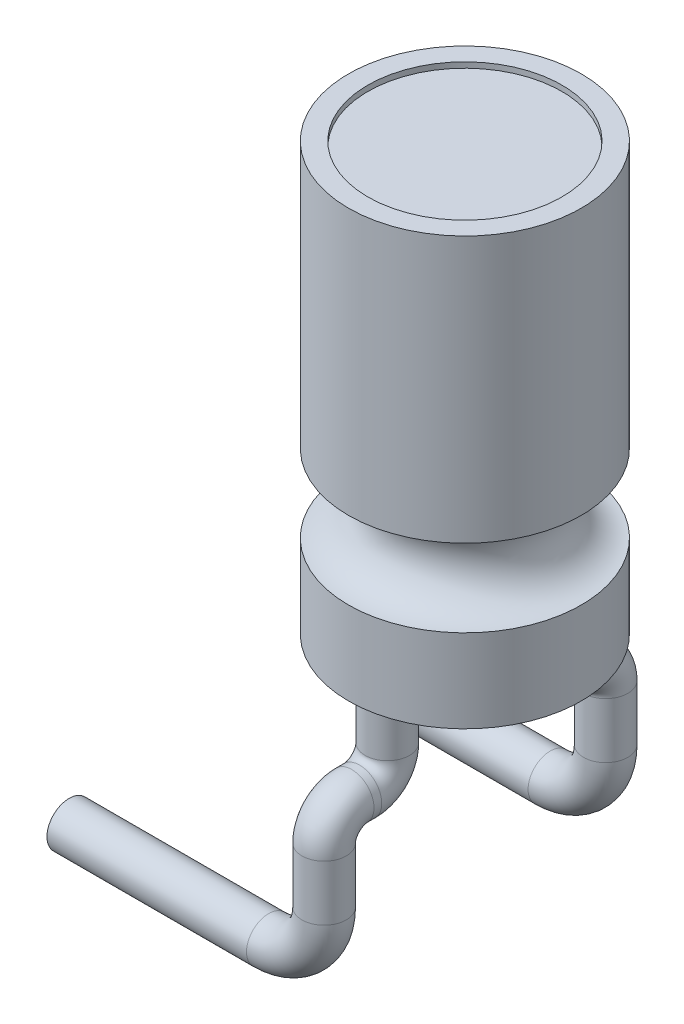
ISO-10303-21;
HEADER;
FILE_DESCRIPTION(('STEP AP214'),'2;1');
FILE_NAME('part.step','',(''),(''),'','','');
FILE_SCHEMA(('AUTOMOTIVE_DESIGN { 1 0 10303 214 1 1 1 1 }'));
ENDSEC;
DATA;
#1=APPLICATION_CONTEXT('core data for automotive mechanical design processes');
#2=APPLICATION_PROTOCOL_DEFINITION('international standard','automotive_design',2000,#1);
#3=PRODUCT_CONTEXT('',#1,'mechanical');
#4=PRODUCT('Part','Part','',(#3));
#5=PRODUCT_RELATED_PRODUCT_CATEGORY('part','',(#4));
#6=PRODUCT_DEFINITION_FORMATION('','',#4);
#7=PRODUCT_DEFINITION_CONTEXT('part definition',#1,'design');
#8=PRODUCT_DEFINITION('design','',#6,#7);
#9=PRODUCT_DEFINITION_SHAPE('','',#8);
#10=(LENGTH_UNIT() NAMED_UNIT(*) SI_UNIT(.MILLI.,.METRE.));
#11=(NAMED_UNIT(*) PLANE_ANGLE_UNIT() SI_UNIT($,.RADIAN.));
#12=(NAMED_UNIT(*) SI_UNIT($,.STERADIAN.) SOLID_ANGLE_UNIT());
#13=UNCERTAINTY_MEASURE_WITH_UNIT(LENGTH_MEASURE(1.E-05),#10,'distance_accuracy_value','');
#14=(GEOMETRIC_REPRESENTATION_CONTEXT(3) GLOBAL_UNCERTAINTY_ASSIGNED_CONTEXT((#13)) GLOBAL_UNIT_ASSIGNED_CONTEXT((#10,
#11,#12)) REPRESENTATION_CONTEXT('',''));
#15=CARTESIAN_POINT('',(0.,0.,0.));
#16=DIRECTION('',(0.,0.,1.));
#17=DIRECTION('',(1.,0.,0.));
#18=AXIS2_PLACEMENT_3D('',#15,#16,#17);
#19=CARTESIAN_POINT('',(2.1,27.5164236634825,0.));
#20=DIRECTION('',(0.,1.,0.));
#21=DIRECTION('',(0.,0.,1.));
#22=AXIS2_PLACEMENT_3D('',#19,#20,#21);
#23=PLANE('',#22);
#24=CARTESIAN_POINT('',(0.,27.5164236634825,-1.4));
#25=DIRECTION('',(0.,1.,0.));
#26=DIRECTION('',(0.,0.,1.));
#27=AXIS2_PLACEMENT_3D('',#24,#25,#26);
#28=CIRCLE('',#27,0.4);
#29=CARTESIAN_POINT('',(0.,27.5164236634825,-1.));
#30=VERTEX_POINT('',#29);
#31=EDGE_CURVE('E93',#30,#30,#28,.T.);
#32=ORIENTED_EDGE('',*,*,#31,.T.);
#33=EDGE_LOOP('',(#32));
#34=FACE_BOUND('',#33,.T.);
#35=CARTESIAN_POINT('',(0.,27.5164236634825,0.));
#36=DIRECTION('',(0.,1.,0.));
#37=DIRECTION('',(0.,0.,1.));
#38=AXIS2_PLACEMENT_3D('',#35,#36,#37);
#39=CIRCLE('',#38,2.1);
#40=CARTESIAN_POINT('',(0.,27.5164236634825,2.1));
#41=VERTEX_POINT('',#40);
#42=EDGE_CURVE('E41',#41,#41,#39,.T.);
#43=ORIENTED_EDGE('',*,*,#42,.F.);
#44=EDGE_LOOP('',(#43));
#45=FACE_BOUND('',#44,.T.);
#46=CARTESIAN_POINT('',(0.,27.5164236634825,1.4));
#47=DIRECTION('',(0.,1.,0.));
#48=DIRECTION('',(0.,0.,1.));
#49=AXIS2_PLACEMENT_3D('',#46,#47,#48);
#50=CIRCLE('',#49,0.4);
#51=CARTESIAN_POINT('',(0.,27.5164236634825,1.8));
#52=VERTEX_POINT('',#51);
#53=EDGE_CURVE('E10',#52,#52,#50,.F.);
#54=ORIENTED_EDGE('',*,*,#53,.F.);
#55=EDGE_LOOP('',(#54));
#56=FACE_BOUND('',#55,.T.);
#57=ADVANCED_FACE('F35',(#34,#45,#56),#23,.F.);
#58=CARTESIAN_POINT('',(0.,48.4017094017094,0.));
#59=DIRECTION('',(0.,1.,0.));
#60=DIRECTION('',(0.,0.,1.));
#61=AXIS2_PLACEMENT_3D('',#58,#59,#60);
#62=CYLINDRICAL_SURFACE('',#61,2.1);
#63=CARTESIAN_POINT('',(0.,29.0164236634825,0.));
#64=DIRECTION('',(0.,1.,0.));
#65=DIRECTION('',(0.,0.,1.));
#66=AXIS2_PLACEMENT_3D('',#63,#64,#65);
#67=CIRCLE('',#66,2.1);
#68=CARTESIAN_POINT('',(0.,29.0164236634825,2.1));
#69=VERTEX_POINT('',#68);
#70=EDGE_CURVE('E45',#69,#69,#67,.T.);
#71=ORIENTED_EDGE('',*,*,#70,.F.);
#72=EDGE_LOOP('',(#71));
#73=FACE_BOUND('',#72,.T.);
#74=ORIENTED_EDGE('',*,*,#42,.T.);
#75=EDGE_LOOP('',(#74));
#76=FACE_BOUND('',#75,.T.);
#77=ADVANCED_FACE('F127',(#73,#76),#62,.T.);
#78=CARTESIAN_POINT('',(0.,29.7164236634825,0.));
#79=DIRECTION('',(0.,1.,0.));
#80=DIRECTION('',(0.,0.,1.));
#81=AXIS2_PLACEMENT_3D('',#78,#79,#80);
#82=TOROIDAL_SURFACE('',#81,2.1,0.699999999999999);
#83=CARTESIAN_POINT('',(0.,30.4164236634825,0.));
#84=DIRECTION('',(0.,1.,0.));
#85=DIRECTION('',(0.,0.,1.));
#86=AXIS2_PLACEMENT_3D('',#83,#84,#85);
#87=CIRCLE('',#86,2.1);
#88=CARTESIAN_POINT('',(0.,30.4164236634825,2.1));
#89=VERTEX_POINT('',#88);
#90=EDGE_CURVE('E49',#89,#89,#87,.T.);
#91=ORIENTED_EDGE('',*,*,#90,.F.);
#92=EDGE_LOOP('',(#91));
#93=FACE_BOUND('',#92,.T.);
#94=ORIENTED_EDGE('',*,*,#70,.T.);
#95=EDGE_LOOP('',(#94));
#96=FACE_BOUND('',#95,.T.);
#97=ADVANCED_FACE('F132',(#93,#96),#82,.F.);
#98=CARTESIAN_POINT('',(0.,48.4017094017094,0.));
#99=DIRECTION('',(0.,1.,0.));
#100=DIRECTION('',(0.,0.,1.));
#101=AXIS2_PLACEMENT_3D('',#98,#99,#100);
#102=CYLINDRICAL_SURFACE('',#101,2.1);
#103=CARTESIAN_POINT('',(0.,35.2164236634825,0.));
#104=DIRECTION('',(0.,1.,0.));
#105=DIRECTION('',(0.,0.,1.));
#106=AXIS2_PLACEMENT_3D('',#103,#104,#105);
#107=CIRCLE('',#106,2.1);
#108=CARTESIAN_POINT('',(0.,35.2164236634825,2.1));
#109=VERTEX_POINT('',#108);
#110=EDGE_CURVE('E54',#109,#109,#107,.T.);
#111=ORIENTED_EDGE('',*,*,#110,.F.);
#112=EDGE_LOOP('',(#111));
#113=FACE_BOUND('',#112,.T.);
#114=ORIENTED_EDGE('',*,*,#90,.T.);
#115=EDGE_LOOP('',(#114));
#116=FACE_BOUND('',#115,.T.);
#117=ADVANCED_FACE('F202',(#113,#116),#102,.T.);
#118=CARTESIAN_POINT('',(0.,35.2164236634825,0.));
#119=DIRECTION('',(0.,-1.,0.));
#120=DIRECTION('',(0.,0.,-1.));
#121=AXIS2_PLACEMENT_3D('',#118,#119,#120);
#122=PLANE('',#121);
#123=CARTESIAN_POINT('',(0.,35.2164236634825,0.));
#124=DIRECTION('',(0.,1.,0.));
#125=DIRECTION('',(0.,0.,1.));
#126=AXIS2_PLACEMENT_3D('',#123,#124,#125);
#127=CIRCLE('',#126,1.75);
#128=CARTESIAN_POINT('',(0.,35.2164236634825,1.75));
#129=VERTEX_POINT('',#128);
#130=EDGE_CURVE('E60',#129,#129,#127,.T.);
#131=ORIENTED_EDGE('',*,*,#130,.F.);
#132=EDGE_LOOP('',(#131));
#133=FACE_BOUND('',#132,.T.);
#134=ORIENTED_EDGE('',*,*,#110,.T.);
#135=EDGE_LOOP('',(#134));
#136=FACE_BOUND('',#135,.T.);
#137=ADVANCED_FACE('F198',(#133,#136),#122,.F.);
#138=CARTESIAN_POINT('',(0.,35.1164236634825,0.));
#139=DIRECTION('',(0.,1.,0.));
#140=DIRECTION('',(0.,0.,1.));
#141=AXIS2_PLACEMENT_3D('',#138,#139,#140);
#142=CYLINDRICAL_SURFACE('',#141,1.75);
#143=CARTESIAN_POINT('',(0.,35.1164236634825,0.));
#144=DIRECTION('',(0.,1.,0.));
#145=DIRECTION('',(0.,0.,1.));
#146=AXIS2_PLACEMENT_3D('',#143,#144,#145);
#147=CIRCLE('',#146,1.75);
#148=CARTESIAN_POINT('',(0.,35.1164236634825,1.75));
#149=VERTEX_POINT('',#148);
#150=EDGE_CURVE('E57',#149,#149,#147,.T.);
#151=ORIENTED_EDGE('',*,*,#150,.F.);
#152=EDGE_LOOP('',(#151));
#153=FACE_BOUND('',#152,.T.);
#154=ORIENTED_EDGE('',*,*,#130,.T.);
#155=EDGE_LOOP('',(#154));
#156=FACE_BOUND('',#155,.T.);
#157=ADVANCED_FACE('F194',(#153,#156),#142,.F.);
#158=CARTESIAN_POINT('',(0.,35.1164236634825,0.));
#159=DIRECTION('',(0.,1.,0.));
#160=DIRECTION('',(0.,0.,1.));
#161=AXIS2_PLACEMENT_3D('',#158,#159,#160);
#162=PLANE('',#161);
#163=ORIENTED_EDGE('',*,*,#150,.T.);
#164=EDGE_LOOP('',(#163));
#165=FACE_BOUND('',#164,.T.);
#166=ADVANCED_FACE('F190',(#165),#162,.T.);
#167=CARTESIAN_POINT('',(0.,25.5164236634825,2.04));
#168=DIRECTION('',(1.,0.,0.));
#169=DIRECTION('',(0.,0.,-1.));
#170=AXIS2_PLACEMENT_3D('',#167,#168,#169);
#171=TOROIDAL_SURFACE('',#170,0.500000000000004,0.4);
#172=CARTESIAN_POINT('',(0.,26.0164236634825,2.04));
#173=DIRECTION('',(0.,0.,1.));
#174=DIRECTION('',(0.,-1.,0.));
#175=AXIS2_PLACEMENT_3D('',#172,#173,#174);
#176=CIRCLE('',#175,0.4);
#177=CARTESIAN_POINT('',(0.,26.4164236634825,2.03999999999999));
#178=VERTEX_POINT('',#177);
#179=EDGE_CURVE('E66',#178,#178,#176,.T.);
#180=CARTESIAN_POINT('',(0.,25.5164236634825,2.54));
#181=DIRECTION('',(0.,-1.,0.));
#182=DIRECTION('',(0.,0.,-1.));
#183=AXIS2_PLACEMENT_3D('',#180,#181,#182);
#184=CIRCLE('',#183,0.4);
#185=CARTESIAN_POINT('',(0.,25.5164236634825,2.94));
#186=VERTEX_POINT('',#185);
#187=EDGE_CURVE('E63',#186,#186,#184,.T.);
#188=CARTESIAN_POINT('',(0.,25.5164236634825,2.04));
#189=DIRECTION('',(1.,0.,0.));
#190=DIRECTION('',(0.,0.,-1.));
#191=AXIS2_PLACEMENT_3D('',#188,#189,#190);
#192=CIRCLE('',#191,0.900000000000004);
#193=EDGE_CURVE('',#178,#186,#192,.T.);
#194=ORIENTED_EDGE('',*,*,#179,.T.);
#195=ORIENTED_EDGE('',*,*,#187,.F.);
#196=ORIENTED_EDGE('',*,*,#193,.T.);
#197=ORIENTED_EDGE('',*,*,#193,.F.);
#198=EDGE_LOOP('',(#194,#196,#195,#197));
#199=FACE_BOUND('',#198,.T.);
#200=ADVANCED_FACE('F186',(#199),#171,.T.);
#201=CARTESIAN_POINT('',(0.,26.0164236634825,1.9));
#202=DIRECTION('',(0.,0.,1.));
#203=DIRECTION('',(1.,0.,0.));
#204=AXIS2_PLACEMENT_3D('',#201,#202,#203);
#205=CYLINDRICAL_SURFACE('',#204,0.4);
#206=CARTESIAN_POINT('',(0.,26.0164236634825,1.9));
#207=DIRECTION('',(0.,0.,1.));
#208=DIRECTION('',(0.,-1.,0.));
#209=AXIS2_PLACEMENT_3D('',#206,#207,#208);
#210=CIRCLE('',#209,0.4);
#211=CARTESIAN_POINT('',(0.,25.6164236634825,1.9));
#212=VERTEX_POINT('',#211);
#213=EDGE_CURVE('E69',#212,#212,#210,.T.);
#214=ORIENTED_EDGE('',*,*,#213,.T.);
#215=EDGE_LOOP('',(#214));
#216=FACE_BOUND('',#215,.T.);
#217=ORIENTED_EDGE('',*,*,#179,.F.);
#218=EDGE_LOOP('',(#217));
#219=FACE_BOUND('',#218,.T.);
#220=ADVANCED_FACE('F182',(#216,#219),#205,.T.);
#221=CARTESIAN_POINT('',(0.,26.5164236634825,1.9));
#222=DIRECTION('',(-1.,0.,0.));
#223=DIRECTION('',(0.,0.,1.));
#224=AXIS2_PLACEMENT_3D('',#221,#222,#223);
#225=TOROIDAL_SURFACE('',#224,0.5,0.4);
#226=CARTESIAN_POINT('',(0.,26.5164236634825,1.4));
#227=DIRECTION('',(0.,-1.,0.));
#228=DIRECTION('',(0.,0.,-1.));
#229=AXIS2_PLACEMENT_3D('',#226,#227,#228);
#230=CIRCLE('',#229,0.4);
#231=CARTESIAN_POINT('',(0.,26.5164236634825,1.));
#232=VERTEX_POINT('',#231);
#233=EDGE_CURVE('E72',#232,#232,#230,.T.);
#234=CARTESIAN_POINT('',(0.,26.5164236634825,1.9));
#235=DIRECTION('',(-1.,0.,0.));
#236=DIRECTION('',(0.,0.,1.));
#237=AXIS2_PLACEMENT_3D('',#234,#235,#236);
#238=CIRCLE('',#237,0.9);
#239=EDGE_CURVE('',#232,#212,#238,.T.);
#240=ORIENTED_EDGE('',*,*,#233,.T.);
#241=ORIENTED_EDGE('',*,*,#213,.F.);
#242=ORIENTED_EDGE('',*,*,#239,.T.);
#243=ORIENTED_EDGE('',*,*,#239,.F.);
#244=EDGE_LOOP('',(#240,#242,#241,#243));
#245=FACE_BOUND('',#244,.T.);
#246=ADVANCED_FACE('F178',(#245),#225,.T.);
#247=CARTESIAN_POINT('',(0.,26.5164236634825,1.4));
#248=DIRECTION('',(0.,1.,0.));
#249=DIRECTION('',(0.,0.,1.));
#250=AXIS2_PLACEMENT_3D('',#247,#248,#249);
#251=CYLINDRICAL_SURFACE('',#250,0.4);
#252=ORIENTED_EDGE('',*,*,#233,.F.);
#253=EDGE_LOOP('',(#252));
#254=FACE_BOUND('',#253,.T.);
#255=ORIENTED_EDGE('',*,*,#53,.T.);
#256=EDGE_LOOP('',(#255));
#257=FACE_BOUND('',#256,.T.);
#258=ADVANCED_FACE('F174',(#254,#257),#251,.T.);
#259=CARTESIAN_POINT('',(-1.00000000000001,23.5164236634825,2.54));
#260=DIRECTION('',(-1.,0.,0.));
#261=DIRECTION('',(0.,0.,1.));
#262=AXIS2_PLACEMENT_3D('',#259,#260,#261);
#263=CYLINDRICAL_SURFACE('',#262,0.4);
#264=CARTESIAN_POINT('',(-1.00000000000001,23.5164236634825,2.54));
#265=DIRECTION('',(-1.,0.,0.));
#266=DIRECTION('',(0.,0.,-1.));
#267=AXIS2_PLACEMENT_3D('',#264,#265,#266);
#268=CIRCLE('',#267,0.4);
#269=CARTESIAN_POINT('',(-1.00000000000001,23.1164236634825,2.54));
#270=VERTEX_POINT('',#269);
#271=EDGE_CURVE('E78',#270,#270,#268,.T.);
#272=ORIENTED_EDGE('',*,*,#271,.T.);
#273=EDGE_LOOP('',(#272));
#274=FACE_BOUND('',#273,.T.);
#275=CARTESIAN_POINT('',(-4.6,23.5164236634825,2.54));
#276=DIRECTION('',(-1.,0.,0.));
#277=DIRECTION('',(0.,0.,-1.));
#278=AXIS2_PLACEMENT_3D('',#275,#276,#277);
#279=CIRCLE('',#278,0.4);
#280=CARTESIAN_POINT('',(-4.6,23.5164236634825,2.14));
#281=VERTEX_POINT('',#280);
#282=EDGE_CURVE('E75',#281,#281,#279,.T.);
#283=ORIENTED_EDGE('',*,*,#282,.F.);
#284=EDGE_LOOP('',(#283));
#285=FACE_BOUND('',#284,.T.);
#286=ADVANCED_FACE('F170',(#274,#285),#263,.T.);
#287=CARTESIAN_POINT('',(-1.,24.5164236634825,2.54));
#288=DIRECTION('',(0.,0.,-1.));
#289=DIRECTION('',(-1.,0.,0.));
#290=AXIS2_PLACEMENT_3D('',#287,#288,#289);
#291=TOROIDAL_SURFACE('',#290,1.,0.4);
#292=CARTESIAN_POINT('',(0.,24.5164236634825,2.54));
#293=DIRECTION('',(0.,-1.,0.));
#294=DIRECTION('',(0.,0.,-1.));
#295=AXIS2_PLACEMENT_3D('',#292,#293,#294);
#296=CIRCLE('',#295,0.4);
#297=CARTESIAN_POINT('',(0.4,24.5164236634825,2.54));
#298=VERTEX_POINT('',#297);
#299=EDGE_CURVE('E81',#298,#298,#296,.T.);
#300=CARTESIAN_POINT('',(-1.,24.5164236634825,2.54));
#301=DIRECTION('',(0.,0.,-1.));
#302=DIRECTION('',(-1.,0.,0.));
#303=AXIS2_PLACEMENT_3D('',#300,#301,#302);
#304=CIRCLE('',#303,1.4);
#305=EDGE_CURVE('',#298,#270,#304,.T.);
#306=ORIENTED_EDGE('',*,*,#299,.T.);
#307=ORIENTED_EDGE('',*,*,#271,.F.);
#308=ORIENTED_EDGE('',*,*,#305,.T.);
#309=ORIENTED_EDGE('',*,*,#305,.F.);
#310=EDGE_LOOP('',(#306,#308,#307,#309));
#311=FACE_BOUND('',#310,.T.);
#312=ADVANCED_FACE('F166',(#311),#291,.T.);
#313=CARTESIAN_POINT('',(0.,24.5164236634825,2.54));
#314=DIRECTION('',(0.,1.,0.));
#315=DIRECTION('',(-1.,0.,0.));
#316=AXIS2_PLACEMENT_3D('',#313,#314,#315);
#317=CYLINDRICAL_SURFACE('',#316,0.4);
#318=ORIENTED_EDGE('',*,*,#299,.F.);
#319=EDGE_LOOP('',(#318));
#320=FACE_BOUND('',#319,.T.);
#321=ORIENTED_EDGE('',*,*,#187,.T.);
#322=EDGE_LOOP('',(#321));
#323=FACE_BOUND('',#322,.T.);
#324=ADVANCED_FACE('F162',(#320,#323),#317,.T.);
#325=CARTESIAN_POINT('',(-4.6,23.5164236634825,2.54));
#326=DIRECTION('',(-1.,0.,0.));
#327=DIRECTION('',(0.,0.,-1.));
#328=AXIS2_PLACEMENT_3D('',#325,#326,#327);
#329=PLANE('',#328);
#330=ORIENTED_EDGE('',*,*,#282,.T.);
#331=EDGE_LOOP('',(#330));
#332=FACE_BOUND('',#331,.T.);
#333=ADVANCED_FACE('F158',(#332),#329,.T.);
#334=CARTESIAN_POINT('',(0.,25.5164236634825,-2.04));
#335=DIRECTION('',(-1.,0.,0.));
#336=DIRECTION('',(0.,0.,1.));
#337=AXIS2_PLACEMENT_3D('',#334,#335,#336);
#338=TOROIDAL_SURFACE('',#337,0.500000000000004,0.4);
#339=CARTESIAN_POINT('',(0.,26.0164236634825,-2.04));
#340=DIRECTION('',(0.,0.,1.));
#341=DIRECTION('',(0.,-1.,0.));
#342=AXIS2_PLACEMENT_3D('',#339,#340,#341);
#343=CIRCLE('',#342,0.4);
#344=CARTESIAN_POINT('',(0.,26.4164236634825,-2.03999999999999));
#345=VERTEX_POINT('',#344);
#346=EDGE_CURVE('E84',#345,#345,#343,.T.);
#347=CARTESIAN_POINT('',(0.,25.5164236634825,-2.54));
#348=DIRECTION('',(0.,1.,0.));
#349=DIRECTION('',(0.,0.,1.));
#350=AXIS2_PLACEMENT_3D('',#347,#348,#349);
#351=CIRCLE('',#350,0.4);
#352=CARTESIAN_POINT('',(0.,25.5164236634825,-2.94));
#353=VERTEX_POINT('',#352);
#354=EDGE_CURVE('E105',#353,#353,#351,.T.);
#355=CARTESIAN_POINT('',(0.,25.5164236634825,-2.04));
#356=DIRECTION('',(-1.,0.,0.));
#357=DIRECTION('',(0.,0.,1.));
#358=AXIS2_PLACEMENT_3D('',#355,#356,#357);
#359=CIRCLE('',#358,0.900000000000004);
#360=EDGE_CURVE('',#345,#353,#359,.T.);
#361=ORIENTED_EDGE('',*,*,#346,.F.);
#362=ORIENTED_EDGE('',*,*,#354,.T.);
#363=ORIENTED_EDGE('',*,*,#360,.T.);
#364=ORIENTED_EDGE('',*,*,#360,.F.);
#365=EDGE_LOOP('',(#361,#363,#362,#364));
#366=FACE_BOUND('',#365,.T.);
#367=ADVANCED_FACE('F109',(#366),#338,.T.);
#368=CARTESIAN_POINT('',(0.,26.0164236634825,-1.9));
#369=DIRECTION('',(0.,0.,-1.));
#370=DIRECTION('',(-1.,0.,0.));
#371=AXIS2_PLACEMENT_3D('',#368,#369,#370);
#372=CYLINDRICAL_SURFACE('',#371,0.4);
#373=CARTESIAN_POINT('',(0.,26.0164236634825,-1.9));
#374=DIRECTION('',(0.,0.,1.));
#375=DIRECTION('',(0.,-1.,0.));
#376=AXIS2_PLACEMENT_3D('',#373,#374,#375);
#377=CIRCLE('',#376,0.4);
#378=CARTESIAN_POINT('',(0.,25.6164236634825,-1.9));
#379=VERTEX_POINT('',#378);
#380=EDGE_CURVE('E87',#379,#379,#377,.T.);
#381=ORIENTED_EDGE('',*,*,#380,.F.);
#382=EDGE_LOOP('',(#381));
#383=FACE_BOUND('',#382,.T.);
#384=ORIENTED_EDGE('',*,*,#346,.T.);
#385=EDGE_LOOP('',(#384));
#386=FACE_BOUND('',#385,.T.);
#387=ADVANCED_FACE('F149',(#383,#386),#372,.T.);
#388=CARTESIAN_POINT('',(0.,26.5164236634825,-1.9));
#389=DIRECTION('',(1.,0.,0.));
#390=DIRECTION('',(0.,0.,-1.));
#391=AXIS2_PLACEMENT_3D('',#388,#389,#390);
#392=TOROIDAL_SURFACE('',#391,0.5,0.4);
#393=CARTESIAN_POINT('',(0.,26.5164236634825,-1.4));
#394=DIRECTION('',(0.,1.,0.));
#395=DIRECTION('',(0.,0.,1.));
#396=AXIS2_PLACEMENT_3D('',#393,#394,#395);
#397=CIRCLE('',#396,0.4);
#398=CARTESIAN_POINT('',(0.,26.5164236634825,-1.));
#399=VERTEX_POINT('',#398);
#400=EDGE_CURVE('E90',#399,#399,#397,.T.);
#401=CARTESIAN_POINT('',(0.,26.5164236634825,-1.9));
#402=DIRECTION('',(1.,0.,0.));
#403=DIRECTION('',(0.,0.,-1.));
#404=AXIS2_PLACEMENT_3D('',#401,#402,#403);
#405=CIRCLE('',#404,0.9);
#406=EDGE_CURVE('',#399,#379,#405,.T.);
#407=ORIENTED_EDGE('',*,*,#400,.F.);
#408=ORIENTED_EDGE('',*,*,#380,.T.);
#409=ORIENTED_EDGE('',*,*,#406,.T.);
#410=ORIENTED_EDGE('',*,*,#406,.F.);
#411=EDGE_LOOP('',(#407,#409,#408,#410));
#412=FACE_BOUND('',#411,.T.);
#413=ADVANCED_FACE('F140',(#412),#392,.T.);
#414=CARTESIAN_POINT('',(0.,26.5164236634825,-1.4));
#415=DIRECTION('',(0.,1.,0.));
#416=DIRECTION('',(0.,0.,1.));
#417=AXIS2_PLACEMENT_3D('',#414,#415,#416);
#418=CYLINDRICAL_SURFACE('',#417,0.4);
#419=ORIENTED_EDGE('',*,*,#400,.T.);
#420=EDGE_LOOP('',(#419));
#421=FACE_BOUND('',#420,.T.);
#422=ORIENTED_EDGE('',*,*,#31,.F.);
#423=EDGE_LOOP('',(#422));
#424=FACE_BOUND('',#423,.T.);
#425=ADVANCED_FACE('F138',(#421,#424),#418,.T.);
#426=CARTESIAN_POINT('',(-1.00000000000001,23.5164236634825,-2.54));
#427=DIRECTION('',(-1.,0.,0.));
#428=DIRECTION('',(0.,0.,1.));
#429=AXIS2_PLACEMENT_3D('',#426,#427,#428);
#430=CYLINDRICAL_SURFACE('',#429,0.4);
#431=CARTESIAN_POINT('',(-1.00000000000001,23.5164236634825,-2.54));
#432=DIRECTION('',(1.,0.,0.));
#433=DIRECTION('',(0.,0.,1.));
#434=AXIS2_PLACEMENT_3D('',#431,#432,#433);
#435=CIRCLE('',#434,0.4);
#436=CARTESIAN_POINT('',(-1.00000000000001,23.1164236634825,-2.54));
#437=VERTEX_POINT('',#436);
#438=EDGE_CURVE('E99',#437,#437,#435,.T.);
#439=ORIENTED_EDGE('',*,*,#438,.F.);
#440=EDGE_LOOP('',(#439));
#441=FACE_BOUND('',#440,.T.);
#442=CARTESIAN_POINT('',(-4.6,23.5164236634825,-2.54));
#443=DIRECTION('',(1.,0.,0.));
#444=DIRECTION('',(0.,0.,1.));
#445=AXIS2_PLACEMENT_3D('',#442,#443,#444);
#446=CIRCLE('',#445,0.4);
#447=CARTESIAN_POINT('',(-4.6,23.5164236634825,-2.14));
#448=VERTEX_POINT('',#447);
#449=EDGE_CURVE('E96',#448,#448,#446,.T.);
#450=ORIENTED_EDGE('',*,*,#449,.T.);
#451=EDGE_LOOP('',(#450));
#452=FACE_BOUND('',#451,.T.);
#453=ADVANCED_FACE('F123',(#441,#452),#430,.T.);
#454=CARTESIAN_POINT('',(-1.,24.5164236634825,-2.54));
#455=DIRECTION('',(0.,0.,-1.));
#456=DIRECTION('',(-1.,0.,0.));
#457=AXIS2_PLACEMENT_3D('',#454,#455,#456);
#458=TOROIDAL_SURFACE('',#457,1.,0.4);
#459=CARTESIAN_POINT('',(0.,24.5164236634825,-2.54));
#460=DIRECTION('',(0.,1.,0.));
#461=DIRECTION('',(0.,0.,1.));
#462=AXIS2_PLACEMENT_3D('',#459,#460,#461);
#463=CIRCLE('',#462,0.4);
#464=CARTESIAN_POINT('',(0.4,24.5164236634825,-2.54));
#465=VERTEX_POINT('',#464);
#466=EDGE_CURVE('E102',#465,#465,#463,.T.);
#467=CARTESIAN_POINT('',(-1.,24.5164236634825,-2.54));
#468=DIRECTION('',(0.,0.,-1.));
#469=DIRECTION('',(-1.,0.,0.));
#470=AXIS2_PLACEMENT_3D('',#467,#468,#469);
#471=CIRCLE('',#470,1.4);
#472=EDGE_CURVE('',#465,#437,#471,.T.);
#473=ORIENTED_EDGE('',*,*,#466,.F.);
#474=ORIENTED_EDGE('',*,*,#438,.T.);
#475=ORIENTED_EDGE('',*,*,#472,.T.);
#476=ORIENTED_EDGE('',*,*,#472,.F.);
#477=EDGE_LOOP('',(#473,#475,#474,#476));
#478=FACE_BOUND('',#477,.T.);
#479=ADVANCED_FACE('F114',(#478),#458,.T.);
#480=CARTESIAN_POINT('',(0.,24.5164236634825,-2.54));
#481=DIRECTION('',(0.,1.,0.));
#482=DIRECTION('',(-1.,0.,0.));
#483=AXIS2_PLACEMENT_3D('',#480,#481,#482);
#484=CYLINDRICAL_SURFACE('',#483,0.4);
#485=ORIENTED_EDGE('',*,*,#466,.T.);
#486=EDGE_LOOP('',(#485));
#487=FACE_BOUND('',#486,.T.);
#488=ORIENTED_EDGE('',*,*,#354,.F.);
#489=EDGE_LOOP('',(#488));
#490=FACE_BOUND('',#489,.T.);
#491=ADVANCED_FACE('F111',(#487,#490),#484,.T.);
#492=CARTESIAN_POINT('',(-4.6,23.5164236634825,-2.54));
#493=DIRECTION('',(-1.,0.,0.));
#494=DIRECTION('',(0.,0.,1.));
#495=AXIS2_PLACEMENT_3D('',#492,#493,#494);
#496=PLANE('',#495);
#497=ORIENTED_EDGE('',*,*,#449,.F.);
#498=EDGE_LOOP('',(#497));
#499=FACE_BOUND('',#498,.T.);
#500=ADVANCED_FACE('F113',(#499),#496,.T.);
#501=CLOSED_SHELL('',(#57,#77,#97,#117,#137,#157,#166,#200,#220,#246,#258,#286,#312,#324,#333,
#367,#387,#413,#425,#453,#479,#491,#500));
#502=MANIFOLD_SOLID_BREP('B2',#501);
#503=ADVANCED_BREP_SHAPE_REPRESENTATION('',(#18,#502),#14);
#504=SHAPE_DEFINITION_REPRESENTATION(#9,#503);
ENDSEC;
END-ISO-10303-21;
